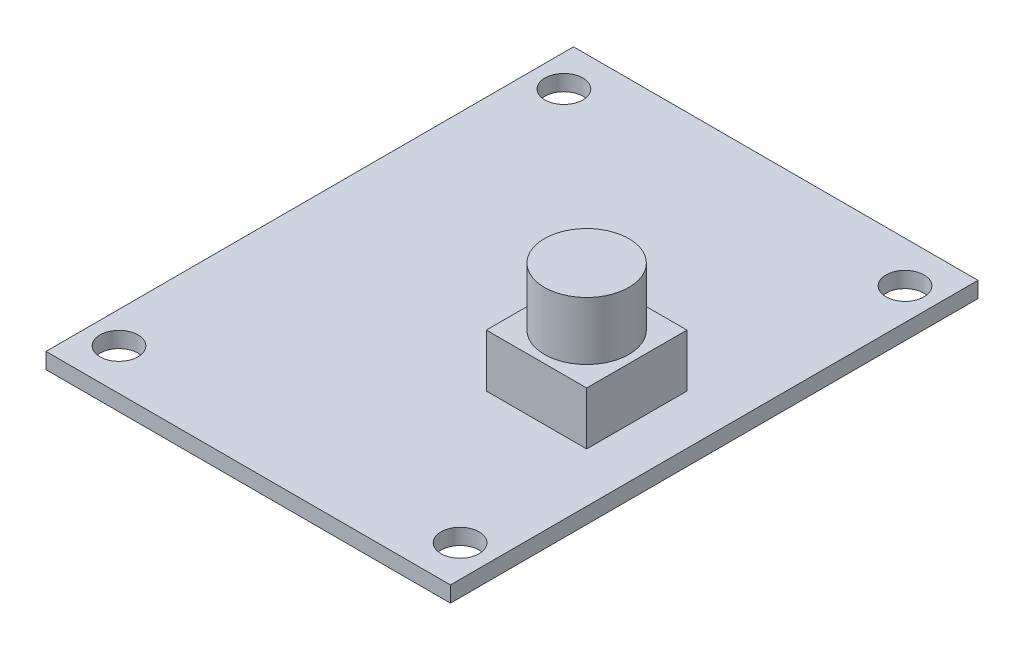
ISO-10303-21;
HEADER;
FILE_DESCRIPTION(('STEP AP214'),'2;1');
FILE_NAME('part.step','',(''),(''),'','','');
FILE_SCHEMA(('AUTOMOTIVE_DESIGN { 1 0 10303 214 1 1 1 1 }'));
ENDSEC;
DATA;
#1=APPLICATION_CONTEXT('core data for automotive mechanical design processes');
#2=APPLICATION_PROTOCOL_DEFINITION('international standard','automotive_design',2000,#1);
#3=PRODUCT_CONTEXT('',#1,'mechanical');
#4=PRODUCT('Part','Part','',(#3));
#5=PRODUCT_RELATED_PRODUCT_CATEGORY('part','',(#4));
#6=PRODUCT_DEFINITION_FORMATION('','',#4);
#7=PRODUCT_DEFINITION_CONTEXT('part definition',#1,'design');
#8=PRODUCT_DEFINITION('design','',#6,#7);
#9=PRODUCT_DEFINITION_SHAPE('','',#8);
#10=(LENGTH_UNIT() NAMED_UNIT(*) SI_UNIT(.MILLI.,.METRE.));
#11=(NAMED_UNIT(*) PLANE_ANGLE_UNIT() SI_UNIT($,.RADIAN.));
#12=(NAMED_UNIT(*) SI_UNIT($,.STERADIAN.) SOLID_ANGLE_UNIT());
#13=UNCERTAINTY_MEASURE_WITH_UNIT(LENGTH_MEASURE(1.E-05),#10,'distance_accuracy_value','');
#14=(GEOMETRIC_REPRESENTATION_CONTEXT(3) GLOBAL_UNCERTAINTY_ASSIGNED_CONTEXT((#13)) GLOBAL_UNIT_ASSIGNED_CONTEXT((#10,
#11,#12)) REPRESENTATION_CONTEXT('',''));
#15=CARTESIAN_POINT('',(0.,0.,0.));
#16=DIRECTION('',(0.,0.,1.));
#17=DIRECTION('',(1.,0.,0.));
#18=AXIS2_PLACEMENT_3D('',#15,#16,#17);
#19=CARTESIAN_POINT('',(4.95,6.5,-2.12000000000001));
#20=DIRECTION('',(1.,0.,0.));
#21=DIRECTION('',(0.,0.,-1.));
#22=AXIS2_PLACEMENT_3D('',#19,#20,#21);
#23=PLANE('',#22);
#24=DIRECTION('',(0.,0.,1.));
#25=VECTOR('',#24,1.);
#26=CARTESIAN_POINT('',(4.95,1.5,-2.12000000000001));
#27=LINE('',#26,#25);
#28=CARTESIAN_POINT('',(4.95,1.5,-2.12000000000001));
#29=VERTEX_POINT('',#28);
#30=CARTESIAN_POINT('',(4.95,1.5,7.37999999999999));
#31=VERTEX_POINT('',#30);
#32=EDGE_CURVE('E171',#29,#31,#27,.T.);
#33=ORIENTED_EDGE('',*,*,#32,.T.);
#34=DIRECTION('',(0.,-1.,0.));
#35=VECTOR('',#34,1.);
#36=CARTESIAN_POINT('',(4.95,6.5,7.37999999999999));
#37=LINE('',#36,#35);
#38=CARTESIAN_POINT('',(4.95,6.5,7.37999999999999));
#39=VERTEX_POINT('',#38);
#40=EDGE_CURVE('E108',#39,#31,#37,.T.);
#41=ORIENTED_EDGE('',*,*,#40,.F.);
#42=DIRECTION('',(0.,0.,1.));
#43=VECTOR('',#42,1.);
#44=CARTESIAN_POINT('',(4.95,6.5,-2.12000000000001));
#45=LINE('',#44,#43);
#46=CARTESIAN_POINT('',(4.95,6.5,-2.12000000000001));
#47=VERTEX_POINT('',#46);
#48=EDGE_CURVE('E158',#47,#39,#45,.T.);
#49=ORIENTED_EDGE('',*,*,#48,.F.);
#50=DIRECTION('',(0.,-1.,0.));
#51=VECTOR('',#50,1.);
#52=CARTESIAN_POINT('',(4.95,6.5,-2.12000000000001));
#53=LINE('',#52,#51);
#54=EDGE_CURVE('E167',#47,#29,#53,.T.);
#55=ORIENTED_EDGE('',*,*,#54,.T.);
#56=EDGE_LOOP('',(#33,#41,#49,#55));
#57=FACE_BOUND('',#56,.T.);
#58=ADVANCED_FACE('F105',(#57),#23,.F.);
#59=CARTESIAN_POINT('',(4.95,6.5,7.37999999999999));
#60=DIRECTION('',(0.,0.,-1.));
#61=DIRECTION('',(-1.,0.,0.));
#62=AXIS2_PLACEMENT_3D('',#59,#60,#61);
#63=PLANE('',#62);
#64=DIRECTION('',(1.,0.,0.));
#65=VECTOR('',#64,1.);
#66=CARTESIAN_POINT('',(4.95,1.5,7.37999999999999));
#67=LINE('',#66,#65);
#68=CARTESIAN_POINT('',(14.45,1.5,7.37999999999999));
#69=VERTEX_POINT('',#68);
#70=EDGE_CURVE('E163',#31,#69,#67,.T.);
#71=ORIENTED_EDGE('',*,*,#70,.T.);
#72=DIRECTION('',(0.,-1.,0.));
#73=VECTOR('',#72,1.);
#74=CARTESIAN_POINT('',(14.45,6.5,7.37999999999999));
#75=LINE('',#74,#73);
#76=CARTESIAN_POINT('',(14.45,6.5,7.37999999999999));
#77=VERTEX_POINT('',#76);
#78=EDGE_CURVE('E161',#77,#69,#75,.T.);
#79=ORIENTED_EDGE('',*,*,#78,.F.);
#80=DIRECTION('',(1.,0.,0.));
#81=VECTOR('',#80,1.);
#82=CARTESIAN_POINT('',(4.95,6.5,7.37999999999999));
#83=LINE('',#82,#81);
#84=EDGE_CURVE('E153',#39,#77,#83,.T.);
#85=ORIENTED_EDGE('',*,*,#84,.F.);
#86=ORIENTED_EDGE('',*,*,#40,.T.);
#87=EDGE_LOOP('',(#71,#79,#85,#86));
#88=FACE_BOUND('',#87,.T.);
#89=ADVANCED_FACE('F162',(#88),#63,.F.);
#90=CARTESIAN_POINT('',(14.45,6.5,-2.12000000000001));
#91=DIRECTION('',(-1.,0.,0.));
#92=DIRECTION('',(0.,0.,1.));
#93=AXIS2_PLACEMENT_3D('',#90,#91,#92);
#94=PLANE('',#93);
#95=DIRECTION('',(0.,0.,-1.));
#96=VECTOR('',#95,1.);
#97=CARTESIAN_POINT('',(14.45,1.5,-2.12000000000001));
#98=LINE('',#97,#96);
#99=CARTESIAN_POINT('',(14.45,1.5,-2.12000000000001));
#100=VERTEX_POINT('',#99);
#101=EDGE_CURVE('E139',#69,#100,#98,.T.);
#102=ORIENTED_EDGE('',*,*,#101,.T.);
#103=DIRECTION('',(0.,-1.,0.));
#104=VECTOR('',#103,1.);
#105=CARTESIAN_POINT('',(14.45,6.5,-2.12000000000001));
#106=LINE('',#105,#104);
#107=CARTESIAN_POINT('',(14.45,6.5,-2.12000000000001));
#108=VERTEX_POINT('',#107);
#109=EDGE_CURVE('E164',#108,#100,#106,.T.);
#110=ORIENTED_EDGE('',*,*,#109,.F.);
#111=DIRECTION('',(0.,0.,-1.));
#112=VECTOR('',#111,1.);
#113=CARTESIAN_POINT('',(14.45,6.5,-2.12000000000001));
#114=LINE('',#113,#112);
#115=EDGE_CURVE('E156',#77,#108,#114,.T.);
#116=ORIENTED_EDGE('',*,*,#115,.F.);
#117=ORIENTED_EDGE('',*,*,#78,.T.);
#118=EDGE_LOOP('',(#102,#110,#116,#117));
#119=FACE_BOUND('',#118,.T.);
#120=ADVANCED_FACE('F165',(#119),#94,.F.);
#121=CARTESIAN_POINT('',(4.95,6.5,-2.12000000000001));
#122=DIRECTION('',(0.,0.,1.));
#123=DIRECTION('',(1.,0.,0.));
#124=AXIS2_PLACEMENT_3D('',#121,#122,#123);
#125=PLANE('',#124);
#126=DIRECTION('',(-1.,0.,0.));
#127=VECTOR('',#126,1.);
#128=CARTESIAN_POINT('',(4.95,1.5,-2.12000000000001));
#129=LINE('',#128,#127);
#130=EDGE_CURVE('E145',#100,#29,#129,.T.);
#131=ORIENTED_EDGE('',*,*,#130,.T.);
#132=ORIENTED_EDGE('',*,*,#54,.F.);
#133=DIRECTION('',(-1.,0.,0.));
#134=VECTOR('',#133,1.);
#135=CARTESIAN_POINT('',(4.95,6.5,-2.12000000000001));
#136=LINE('',#135,#134);
#137=EDGE_CURVE('E122',#108,#47,#136,.T.);
#138=ORIENTED_EDGE('',*,*,#137,.F.);
#139=ORIENTED_EDGE('',*,*,#109,.T.);
#140=EDGE_LOOP('',(#131,#132,#138,#139));
#141=FACE_BOUND('',#140,.T.);
#142=ADVANCED_FACE('F179',(#141),#125,.F.);
#143=CARTESIAN_POINT('',(0.,6.5,0.));
#144=DIRECTION('',(0.,1.,0.));
#145=DIRECTION('',(0.,0.,1.));
#146=AXIS2_PLACEMENT_3D('',#143,#144,#145);
#147=PLANE('',#146);
#148=CARTESIAN_POINT('',(9.7,6.5,2.62999999999999));
#149=DIRECTION('',(0.,1.,0.));
#150=DIRECTION('',(0.,0.,1.));
#151=AXIS2_PLACEMENT_3D('',#148,#149,#150);
#152=CIRCLE('',#151,4.);
#153=CARTESIAN_POINT('',(9.7,6.5,6.62999999999999));
#154=VERTEX_POINT('',#153);
#155=EDGE_CURVE('E13',#154,#154,#152,.T.);
#156=ORIENTED_EDGE('',*,*,#155,.F.);
#157=EDGE_LOOP('',(#156));
#158=FACE_BOUND('',#157,.T.);
#159=ORIENTED_EDGE('',*,*,#48,.T.);
#160=ORIENTED_EDGE('',*,*,#84,.T.);
#161=ORIENTED_EDGE('',*,*,#115,.T.);
#162=ORIENTED_EDGE('',*,*,#137,.T.);
#163=EDGE_LOOP('',(#159,#160,#161,#162));
#164=FACE_BOUND('',#163,.T.);
#165=ADVANCED_FACE('F154',(#158,#164),#147,.T.);
#166=CARTESIAN_POINT('',(0.,1.5,0.));
#167=DIRECTION('',(0.,1.,0.));
#168=DIRECTION('',(0.,0.,1.));
#169=AXIS2_PLACEMENT_3D('',#166,#167,#168);
#170=PLANE('',#169);
#171=ORIENTED_EDGE('',*,*,#32,.F.);
#172=ORIENTED_EDGE('',*,*,#130,.F.);
#173=ORIENTED_EDGE('',*,*,#101,.F.);
#174=ORIENTED_EDGE('',*,*,#70,.F.);
#175=EDGE_LOOP('',(#171,#172,#173,#174));
#176=FACE_BOUND('',#175,.T.);
#177=ADVANCED_FACE('F182',(#176),#170,.F.);
#178=CARTESIAN_POINT('',(9.7,12.,2.62999999999999));
#179=DIRECTION('',(0.,-1.,0.));
#180=DIRECTION('',(0.,0.,-1.));
#181=AXIS2_PLACEMENT_3D('',#178,#179,#180);
#182=CYLINDRICAL_SURFACE('',#181,4.);
#183=CARTESIAN_POINT('',(9.7,12.,2.62999999999999));
#184=DIRECTION('',(0.,1.,0.));
#185=DIRECTION('',(0.,0.,1.));
#186=AXIS2_PLACEMENT_3D('',#183,#184,#185);
#187=CIRCLE('',#186,4.);
#188=CARTESIAN_POINT('',(9.7,12.,6.62999999999999));
#189=VERTEX_POINT('',#188);
#190=EDGE_CURVE('E174',#189,#189,#187,.T.);
#191=ORIENTED_EDGE('',*,*,#190,.F.);
#192=EDGE_LOOP('',(#191));
#193=FACE_BOUND('',#192,.T.);
#194=ORIENTED_EDGE('',*,*,#155,.T.);
#195=EDGE_LOOP('',(#194));
#196=FACE_BOUND('',#195,.T.);
#197=ADVANCED_FACE('F190',(#193,#196),#182,.T.);
#198=CARTESIAN_POINT('',(9.7,12.,2.62999999999999));
#199=DIRECTION('',(0.,1.,0.));
#200=DIRECTION('',(0.,0.,1.));
#201=AXIS2_PLACEMENT_3D('',#198,#199,#200);
#202=PLANE('',#201);
#203=ORIENTED_EDGE('',*,*,#190,.T.);
#204=EDGE_LOOP('',(#203));
#205=FACE_BOUND('',#204,.T.);
#206=ADVANCED_FACE('F188',(#205),#202,.T.);
#207=CLOSED_SHELL('',(#58,#89,#120,#142,#165,#177,#197,#206));
#208=MANIFOLD_SOLID_BREP('B2',#207);
#209=CARTESIAN_POINT('',(0.,1.5,0.));
#210=DIRECTION('',(0.,1.,0.));
#211=DIRECTION('',(0.,0.,1.));
#212=AXIS2_PLACEMENT_3D('',#209,#210,#211);
#213=PLANE('',#212);
#214=CARTESIAN_POINT('',(-16.15,1.5,-21.0666840731071));
#215=DIRECTION('',(0.,1.,0.));
#216=DIRECTION('',(0.,0.,1.));
#217=AXIS2_PLACEMENT_3D('',#214,#215,#216);
#218=CIRCLE('',#217,1.8);
#219=CARTESIAN_POINT('',(-16.15,1.5,-19.2666840731071));
#220=VERTEX_POINT('',#219);
#221=EDGE_CURVE('E344',#220,#220,#218,.T.);
#222=ORIENTED_EDGE('',*,*,#221,.F.);
#223=EDGE_LOOP('',(#222));
#224=FACE_BOUND('',#223,.T.);
#225=CARTESIAN_POINT('',(-16.15,1.5,21.066684073107));
#226=DIRECTION('',(0.,1.,0.));
#227=DIRECTION('',(0.,0.,1.));
#228=AXIS2_PLACEMENT_3D('',#225,#226,#227);
#229=CIRCLE('',#228,1.8);
#230=CARTESIAN_POINT('',(-16.15,1.5,22.866684073107));
#231=VERTEX_POINT('',#230);
#232=EDGE_CURVE('E325',#231,#231,#229,.T.);
#233=ORIENTED_EDGE('',*,*,#232,.F.);
#234=EDGE_LOOP('',(#233));
#235=FACE_BOUND('',#234,.T.);
#236=DIRECTION('',(-1.,0.,0.));
#237=VECTOR('',#236,1.);
#238=CARTESIAN_POINT('',(19.15,1.5,-24.98));
#239=LINE('',#238,#237);
#240=CARTESIAN_POINT('',(19.15,1.5,-24.98));
#241=VERTEX_POINT('',#240);
#242=CARTESIAN_POINT('',(-19.15,1.5,-24.98));
#243=VERTEX_POINT('',#242);
#244=EDGE_CURVE('E309',#241,#243,#239,.T.);
#245=ORIENTED_EDGE('',*,*,#244,.T.);
#246=DIRECTION('',(0.,0.,1.));
#247=VECTOR('',#246,1.);
#248=CARTESIAN_POINT('',(-19.15,1.5,-24.98));
#249=LINE('',#248,#247);
#250=CARTESIAN_POINT('',(-19.15,1.5,24.98));
#251=VERTEX_POINT('',#250);
#252=EDGE_CURVE('E301',#243,#251,#249,.T.);
#253=ORIENTED_EDGE('',*,*,#252,.T.);
#254=DIRECTION('',(-1.,0.,0.));
#255=VECTOR('',#254,1.);
#256=CARTESIAN_POINT('',(19.15,1.5,24.98));
#257=LINE('',#256,#255);
#258=CARTESIAN_POINT('',(19.15,1.5,24.98));
#259=VERTEX_POINT('',#258);
#260=EDGE_CURVE('E308',#259,#251,#257,.T.);
#261=ORIENTED_EDGE('',*,*,#260,.F.);
#262=DIRECTION('',(0.,0.,1.));
#263=VECTOR('',#262,1.);
#264=CARTESIAN_POINT('',(19.15,1.5,-24.98));
#265=LINE('',#264,#263);
#266=EDGE_CURVE('E318',#241,#259,#265,.T.);
#267=ORIENTED_EDGE('',*,*,#266,.F.);
#268=EDGE_LOOP('',(#245,#253,#261,#267));
#269=FACE_BOUND('',#268,.T.);
#270=CARTESIAN_POINT('',(16.15,1.5,21.066684073107));
#271=DIRECTION('',(0.,1.,0.));
#272=DIRECTION('',(0.,0.,1.));
#273=AXIS2_PLACEMENT_3D('',#270,#271,#272);
#274=CIRCLE('',#273,1.8);
#275=CARTESIAN_POINT('',(16.15,1.5,22.866684073107));
#276=VERTEX_POINT('',#275);
#277=EDGE_CURVE('E338',#276,#276,#274,.T.);
#278=ORIENTED_EDGE('',*,*,#277,.F.);
#279=EDGE_LOOP('',(#278));
#280=FACE_BOUND('',#279,.T.);
#281=CARTESIAN_POINT('',(16.15,1.5,-21.0666840731071));
#282=DIRECTION('',(0.,1.,0.));
#283=DIRECTION('',(0.,0.,1.));
#284=AXIS2_PLACEMENT_3D('',#281,#282,#283);
#285=CIRCLE('',#284,1.8);
#286=CARTESIAN_POINT('',(16.15,1.5,-19.2666840731071));
#287=VERTEX_POINT('',#286);
#288=EDGE_CURVE('E350',#287,#287,#285,.T.);
#289=ORIENTED_EDGE('',*,*,#288,.F.);
#290=EDGE_LOOP('',(#289));
#291=FACE_BOUND('',#290,.T.);
#292=ADVANCED_FACE('F259',(#224,#235,#269,#280,#291),#213,.T.);
#293=CARTESIAN_POINT('',(0.,0.,0.));
#294=DIRECTION('',(0.,1.,0.));
#295=DIRECTION('',(0.,0.,1.));
#296=AXIS2_PLACEMENT_3D('',#293,#294,#295);
#297=PLANE('',#296);
#298=DIRECTION('',(-1.,0.,0.));
#299=VECTOR('',#298,1.);
#300=CARTESIAN_POINT('',(19.15,0.,-24.98));
#301=LINE('',#300,#299);
#302=CARTESIAN_POINT('',(19.15,0.,-24.98));
#303=VERTEX_POINT('',#302);
#304=CARTESIAN_POINT('',(-19.15,0.,-24.98));
#305=VERTEX_POINT('',#304);
#306=EDGE_CURVE('E323',#303,#305,#301,.T.);
#307=ORIENTED_EDGE('',*,*,#306,.F.);
#308=DIRECTION('',(0.,0.,1.));
#309=VECTOR('',#308,1.);
#310=CARTESIAN_POINT('',(19.15,0.,-24.98));
#311=LINE('',#310,#309);
#312=CARTESIAN_POINT('',(19.15,0.,24.98));
#313=VERTEX_POINT('',#312);
#314=EDGE_CURVE('E329',#303,#313,#311,.T.);
#315=ORIENTED_EDGE('',*,*,#314,.T.);
#316=DIRECTION('',(-1.,0.,0.));
#317=VECTOR('',#316,1.);
#318=CARTESIAN_POINT('',(19.15,0.,24.98));
#319=LINE('',#318,#317);
#320=CARTESIAN_POINT('',(-19.15,0.,24.98));
#321=VERTEX_POINT('',#320);
#322=EDGE_CURVE('E327',#313,#321,#319,.T.);
#323=ORIENTED_EDGE('',*,*,#322,.T.);
#324=DIRECTION('',(0.,0.,1.));
#325=VECTOR('',#324,1.);
#326=CARTESIAN_POINT('',(-19.15,0.,-24.98));
#327=LINE('',#326,#325);
#328=EDGE_CURVE('E314',#305,#321,#327,.T.);
#329=ORIENTED_EDGE('',*,*,#328,.F.);
#330=EDGE_LOOP('',(#307,#315,#323,#329));
#331=FACE_BOUND('',#330,.T.);
#332=CARTESIAN_POINT('',(-16.15,0.,21.066684073107));
#333=DIRECTION('',(0.,1.,0.));
#334=DIRECTION('',(0.,0.,1.));
#335=AXIS2_PLACEMENT_3D('',#332,#333,#334);
#336=CIRCLE('',#335,1.8);
#337=CARTESIAN_POINT('',(-16.15,0.,22.866684073107));
#338=VERTEX_POINT('',#337);
#339=EDGE_CURVE('E335',#338,#338,#336,.T.);
#340=ORIENTED_EDGE('',*,*,#339,.T.);
#341=EDGE_LOOP('',(#340));
#342=FACE_BOUND('',#341,.T.);
#343=CARTESIAN_POINT('',(16.15,0.,21.066684073107));
#344=DIRECTION('',(0.,1.,0.));
#345=DIRECTION('',(0.,0.,1.));
#346=AXIS2_PLACEMENT_3D('',#343,#344,#345);
#347=CIRCLE('',#346,1.8);
#348=CARTESIAN_POINT('',(16.15,0.,22.866684073107));
#349=VERTEX_POINT('',#348);
#350=EDGE_CURVE('E341',#349,#349,#347,.T.);
#351=ORIENTED_EDGE('',*,*,#350,.T.);
#352=EDGE_LOOP('',(#351));
#353=FACE_BOUND('',#352,.T.);
#354=CARTESIAN_POINT('',(-16.15,0.,-21.0666840731071));
#355=DIRECTION('',(0.,1.,0.));
#356=DIRECTION('',(0.,0.,1.));
#357=AXIS2_PLACEMENT_3D('',#354,#355,#356);
#358=CIRCLE('',#357,1.8);
#359=CARTESIAN_POINT('',(-16.15,0.,-19.2666840731071));
#360=VERTEX_POINT('',#359);
#361=EDGE_CURVE('E347',#360,#360,#358,.T.);
#362=ORIENTED_EDGE('',*,*,#361,.T.);
#363=EDGE_LOOP('',(#362));
#364=FACE_BOUND('',#363,.T.);
#365=CARTESIAN_POINT('',(16.15,0.,-21.0666840731071));
#366=DIRECTION('',(0.,1.,0.));
#367=DIRECTION('',(0.,0.,1.));
#368=AXIS2_PLACEMENT_3D('',#365,#366,#367);
#369=CIRCLE('',#368,1.8);
#370=CARTESIAN_POINT('',(16.15,0.,-19.2666840731071));
#371=VERTEX_POINT('',#370);
#372=EDGE_CURVE('E353',#371,#371,#369,.T.);
#373=ORIENTED_EDGE('',*,*,#372,.T.);
#374=EDGE_LOOP('',(#373));
#375=FACE_BOUND('',#374,.T.);
#376=ADVANCED_FACE('F363',(#331,#342,#353,#364,#375),#297,.F.);
#377=CARTESIAN_POINT('',(19.15,1.5,-24.98));
#378=DIRECTION('',(0.,0.,1.));
#379=DIRECTION('',(1.,0.,0.));
#380=AXIS2_PLACEMENT_3D('',#377,#378,#379);
#381=PLANE('',#380);
#382=ORIENTED_EDGE('',*,*,#306,.T.);
#383=DIRECTION('',(0.,-1.,0.));
#384=VECTOR('',#383,1.);
#385=CARTESIAN_POINT('',(-19.15,1.5,-24.98));
#386=LINE('',#385,#384);
#387=EDGE_CURVE('E103',#243,#305,#386,.T.);
#388=ORIENTED_EDGE('',*,*,#387,.F.);
#389=ORIENTED_EDGE('',*,*,#244,.F.);
#390=DIRECTION('',(0.,-1.,0.));
#391=VECTOR('',#390,1.);
#392=CARTESIAN_POINT('',(19.15,1.5,-24.98));
#393=LINE('',#392,#391);
#394=EDGE_CURVE('E276',#241,#303,#393,.T.);
#395=ORIENTED_EDGE('',*,*,#394,.T.);
#396=EDGE_LOOP('',(#382,#388,#389,#395));
#397=FACE_BOUND('',#396,.T.);
#398=ADVANCED_FACE('F261',(#397),#381,.F.);
#399=CARTESIAN_POINT('',(-19.15,1.5,-24.98));
#400=DIRECTION('',(1.,0.,0.));
#401=DIRECTION('',(0.,0.,-1.));
#402=AXIS2_PLACEMENT_3D('',#399,#400,#401);
#403=PLANE('',#402);
#404=ORIENTED_EDGE('',*,*,#328,.T.);
#405=DIRECTION('',(0.,-1.,0.));
#406=VECTOR('',#405,1.);
#407=CARTESIAN_POINT('',(-19.15,1.5,24.98));
#408=LINE('',#407,#406);
#409=EDGE_CURVE('E268',#251,#321,#408,.T.);
#410=ORIENTED_EDGE('',*,*,#409,.F.);
#411=ORIENTED_EDGE('',*,*,#252,.F.);
#412=ORIENTED_EDGE('',*,*,#387,.T.);
#413=EDGE_LOOP('',(#404,#410,#411,#412));
#414=FACE_BOUND('',#413,.T.);
#415=ADVANCED_FACE('F313',(#414),#403,.F.);
#416=CARTESIAN_POINT('',(19.15,1.5,24.98));
#417=DIRECTION('',(0.,0.,1.));
#418=DIRECTION('',(1.,0.,0.));
#419=AXIS2_PLACEMENT_3D('',#416,#417,#418);
#420=PLANE('',#419);
#421=ORIENTED_EDGE('',*,*,#322,.F.);
#422=DIRECTION('',(0.,-1.,0.));
#423=VECTOR('',#422,1.);
#424=CARTESIAN_POINT('',(19.15,1.5,24.98));
#425=LINE('',#424,#423);
#426=EDGE_CURVE('E290',#259,#313,#425,.T.);
#427=ORIENTED_EDGE('',*,*,#426,.F.);
#428=ORIENTED_EDGE('',*,*,#260,.T.);
#429=ORIENTED_EDGE('',*,*,#409,.T.);
#430=EDGE_LOOP('',(#421,#427,#428,#429));
#431=FACE_BOUND('',#430,.T.);
#432=ADVANCED_FACE('F317',(#431),#420,.T.);
#433=CARTESIAN_POINT('',(19.15,1.5,-24.98));
#434=DIRECTION('',(1.,0.,0.));
#435=DIRECTION('',(0.,0.,-1.));
#436=AXIS2_PLACEMENT_3D('',#433,#434,#435);
#437=PLANE('',#436);
#438=ORIENTED_EDGE('',*,*,#314,.F.);
#439=ORIENTED_EDGE('',*,*,#394,.F.);
#440=ORIENTED_EDGE('',*,*,#266,.T.);
#441=ORIENTED_EDGE('',*,*,#426,.T.);
#442=EDGE_LOOP('',(#438,#439,#440,#441));
#443=FACE_BOUND('',#442,.T.);
#444=ADVANCED_FACE('F376',(#443),#437,.T.);
#445=CARTESIAN_POINT('',(-16.15,1.5,21.066684073107));
#446=DIRECTION('',(0.,-1.,0.));
#447=DIRECTION('',(0.,0.,-1.));
#448=AXIS2_PLACEMENT_3D('',#445,#446,#447);
#449=CYLINDRICAL_SURFACE('',#448,1.8);
#450=ORIENTED_EDGE('',*,*,#232,.T.);
#451=EDGE_LOOP('',(#450));
#452=FACE_BOUND('',#451,.T.);
#453=ORIENTED_EDGE('',*,*,#339,.F.);
#454=EDGE_LOOP('',(#453));
#455=FACE_BOUND('',#454,.T.);
#456=ADVANCED_FACE('F373',(#452,#455),#449,.F.);
#457=CARTESIAN_POINT('',(16.15,1.5,21.066684073107));
#458=DIRECTION('',(0.,-1.,0.));
#459=DIRECTION('',(0.,0.,-1.));
#460=AXIS2_PLACEMENT_3D('',#457,#458,#459);
#461=CYLINDRICAL_SURFACE('',#460,1.8);
#462=ORIENTED_EDGE('',*,*,#277,.T.);
#463=EDGE_LOOP('',(#462));
#464=FACE_BOUND('',#463,.T.);
#465=ORIENTED_EDGE('',*,*,#350,.F.);
#466=EDGE_LOOP('',(#465));
#467=FACE_BOUND('',#466,.T.);
#468=ADVANCED_FACE('F400',(#464,#467),#461,.F.);
#469=CARTESIAN_POINT('',(-16.15,1.5,-21.0666840731071));
#470=DIRECTION('',(0.,-1.,0.));
#471=DIRECTION('',(0.,0.,-1.));
#472=AXIS2_PLACEMENT_3D('',#469,#470,#471);
#473=CYLINDRICAL_SURFACE('',#472,1.8);
#474=ORIENTED_EDGE('',*,*,#221,.T.);
#475=EDGE_LOOP('',(#474));
#476=FACE_BOUND('',#475,.T.);
#477=ORIENTED_EDGE('',*,*,#361,.F.);
#478=EDGE_LOOP('',(#477));
#479=FACE_BOUND('',#478,.T.);
#480=ADVANCED_FACE('F395',(#476,#479),#473,.F.);
#481=CARTESIAN_POINT('',(16.15,1.5,-21.0666840731071));
#482=DIRECTION('',(0.,-1.,0.));
#483=DIRECTION('',(0.,0.,-1.));
#484=AXIS2_PLACEMENT_3D('',#481,#482,#483);
#485=CYLINDRICAL_SURFACE('',#484,1.8);
#486=ORIENTED_EDGE('',*,*,#288,.T.);
#487=EDGE_LOOP('',(#486));
#488=FACE_BOUND('',#487,.T.);
#489=ORIENTED_EDGE('',*,*,#372,.F.);
#490=EDGE_LOOP('',(#489));
#491=FACE_BOUND('',#490,.T.);
#492=ADVANCED_FACE('F359',(#488,#491),#485,.F.);
#493=CLOSED_SHELL('',(#292,#376,#398,#415,#432,#444,#456,#468,#480,#492));
#494=MANIFOLD_SOLID_BREP('B7',#493);
#495=ADVANCED_BREP_SHAPE_REPRESENTATION('',(#18,#208,#494),#14);
#496=SHAPE_DEFINITION_REPRESENTATION(#9,#495);
ENDSEC;
END-ISO-10303-21;
